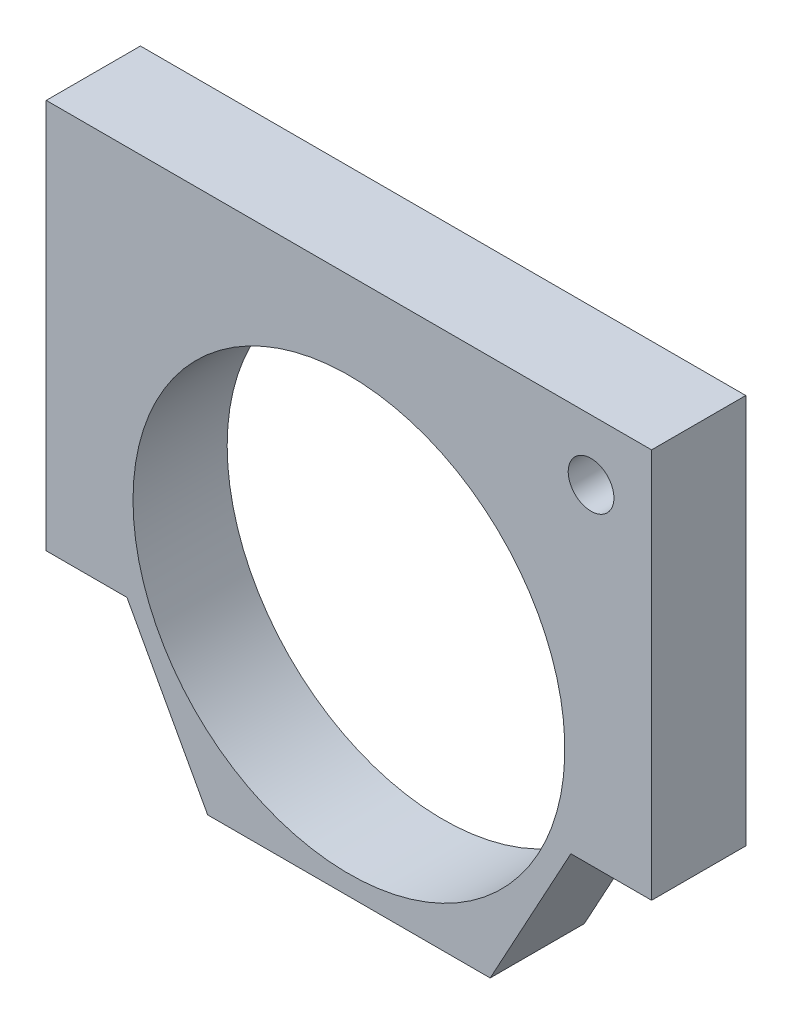
ISO-10303-21;
HEADER;
FILE_DESCRIPTION(('STEP AP214'),'2;1');
FILE_NAME('part.step','',(''),(''),'','','');
FILE_SCHEMA(('AUTOMOTIVE_DESIGN { 1 0 10303 214 1 1 1 1 }'));
ENDSEC;
DATA;
#1=APPLICATION_CONTEXT('core data for automotive mechanical design processes');
#2=APPLICATION_PROTOCOL_DEFINITION('international standard','automotive_design',2000,#1);
#3=PRODUCT_CONTEXT('',#1,'mechanical');
#4=PRODUCT('Part','Part','',(#3));
#5=PRODUCT_RELATED_PRODUCT_CATEGORY('part','',(#4));
#6=PRODUCT_DEFINITION_FORMATION('','',#4);
#7=PRODUCT_DEFINITION_CONTEXT('part definition',#1,'design');
#8=PRODUCT_DEFINITION('design','',#6,#7);
#9=PRODUCT_DEFINITION_SHAPE('','',#8);
#10=(LENGTH_UNIT() NAMED_UNIT(*) SI_UNIT(.MILLI.,.METRE.));
#11=(NAMED_UNIT(*) PLANE_ANGLE_UNIT() SI_UNIT($,.RADIAN.));
#12=(NAMED_UNIT(*) SI_UNIT($,.STERADIAN.) SOLID_ANGLE_UNIT());
#13=UNCERTAINTY_MEASURE_WITH_UNIT(LENGTH_MEASURE(1.E-05),#10,'distance_accuracy_value','');
#14=(GEOMETRIC_REPRESENTATION_CONTEXT(3) GLOBAL_UNCERTAINTY_ASSIGNED_CONTEXT((#13)) GLOBAL_UNIT_ASSIGNED_CONTEXT((#10,
#11,#12)) REPRESENTATION_CONTEXT('',''));
#15=CARTESIAN_POINT('',(0.,0.,0.));
#16=DIRECTION('',(0.,0.,1.));
#17=DIRECTION('',(1.,0.,0.));
#18=AXIS2_PLACEMENT_3D('',#15,#16,#17);
#19=CARTESIAN_POINT('',(0.,0.,3.5));
#20=DIRECTION('',(0.,0.,-1.));
#21=DIRECTION('',(-1.,0.,0.));
#22=AXIS2_PLACEMENT_3D('',#19,#20,#21);
#23=PLANE('',#22);
#24=CARTESIAN_POINT('',(18.,15.5,3.5));
#25=DIRECTION('',(0.,0.,-1.));
#26=DIRECTION('',(-1.,0.,0.));
#27=AXIS2_PLACEMENT_3D('',#24,#25,#26);
#28=CIRCLE('',#27,1.7);
#29=CARTESIAN_POINT('',(16.3,15.5,3.5));
#30=VERTEX_POINT('',#29);
#31=EDGE_CURVE('E250',#30,#30,#28,.F.);
#32=ORIENTED_EDGE('',*,*,#31,.F.);
#33=EDGE_LOOP('',(#32));
#34=FACE_BOUND('',#33,.T.);
#35=DIRECTION('',(1.,0.,0.));
#36=VECTOR('',#35,1.);
#37=CARTESIAN_POINT('',(-22.5,-20.,3.5));
#38=LINE('',#37,#36);
#39=CARTESIAN_POINT('',(-10.5,-20.,3.5));
#40=VERTEX_POINT('',#39);
#41=CARTESIAN_POINT('',(10.5,-20.,3.5));
#42=VERTEX_POINT('',#41);
#43=EDGE_CURVE('E170',#40,#42,#38,.T.);
#44=ORIENTED_EDGE('',*,*,#43,.T.);
#45=DIRECTION('',(0.478852130680573,0.877895572914384,0.));
#46=VECTOR('',#45,1.);
#47=CARTESIAN_POINT('',(16.5,-9.00000000000001,3.5));
#48=LINE('',#47,#46);
#49=CARTESIAN_POINT('',(16.5,-9.,3.5));
#50=VERTEX_POINT('',#49);
#51=EDGE_CURVE('E65',#42,#50,#48,.T.);
#52=ORIENTED_EDGE('',*,*,#51,.T.);
#53=DIRECTION('',(1.,0.,0.));
#54=VECTOR('',#53,1.);
#55=CARTESIAN_POINT('',(0.,-9.,3.5));
#56=LINE('',#55,#54);
#57=CARTESIAN_POINT('',(22.5,-9.,3.5));
#58=VERTEX_POINT('',#57);
#59=EDGE_CURVE('E146',#50,#58,#56,.T.);
#60=ORIENTED_EDGE('',*,*,#59,.T.);
#61=DIRECTION('',(0.,1.,0.));
#62=VECTOR('',#61,1.);
#63=CARTESIAN_POINT('',(22.5,-20.,3.5));
#64=LINE('',#63,#62);
#65=CARTESIAN_POINT('',(22.5,20.,3.5));
#66=VERTEX_POINT('',#65);
#67=EDGE_CURVE('E163',#58,#66,#64,.T.);
#68=ORIENTED_EDGE('',*,*,#67,.T.);
#69=DIRECTION('',(-1.,0.,0.));
#70=VECTOR('',#69,1.);
#71=CARTESIAN_POINT('',(-22.5,20.,3.5));
#72=LINE('',#71,#70);
#73=CARTESIAN_POINT('',(-22.5,20.,3.5));
#74=VERTEX_POINT('',#73);
#75=EDGE_CURVE('E165',#66,#74,#72,.T.);
#76=ORIENTED_EDGE('',*,*,#75,.T.);
#77=DIRECTION('',(0.,-1.,0.));
#78=VECTOR('',#77,1.);
#79=CARTESIAN_POINT('',(-22.5,-20.,3.5));
#80=LINE('',#79,#78);
#81=CARTESIAN_POINT('',(-22.5,-9.,3.5));
#82=VERTEX_POINT('',#81);
#83=EDGE_CURVE('E167',#74,#82,#80,.T.);
#84=ORIENTED_EDGE('',*,*,#83,.T.);
#85=DIRECTION('',(1.,0.,0.));
#86=VECTOR('',#85,1.);
#87=CARTESIAN_POINT('',(0.,-9.,3.5));
#88=LINE('',#87,#86);
#89=CARTESIAN_POINT('',(-16.5,-9.,3.5));
#90=VERTEX_POINT('',#89);
#91=EDGE_CURVE('E132',#82,#90,#88,.T.);
#92=ORIENTED_EDGE('',*,*,#91,.T.);
#93=DIRECTION('',(0.478852130680574,-0.877895572914384,0.));
#94=VECTOR('',#93,1.);
#95=CARTESIAN_POINT('',(-16.5,-9.00000000000001,3.5));
#96=LINE('',#95,#94);
#97=EDGE_CURVE('E137',#90,#40,#96,.T.);
#98=ORIENTED_EDGE('',*,*,#97,.T.);
#99=EDGE_LOOP('',(#44,#52,#60,#68,#76,#84,#92,#98));
#100=FACE_BOUND('',#99,.T.);
#101=CARTESIAN_POINT('',(0.,-2.5,3.5));
#102=DIRECTION('',(0.,0.,-1.));
#103=DIRECTION('',(-1.,0.,0.));
#104=AXIS2_PLACEMENT_3D('',#101,#102,#103);
#105=CIRCLE('',#104,16.05);
#106=CARTESIAN_POINT('',(-16.05,-2.5,3.5));
#107=VERTEX_POINT('',#106);
#108=EDGE_CURVE('E176',#107,#107,#105,.F.);
#109=ORIENTED_EDGE('',*,*,#108,.F.);
#110=EDGE_LOOP('',(#109));
#111=FACE_BOUND('',#110,.T.);
#112=ADVANCED_FACE('F48',(#34,#100,#111),#23,.F.);
#113=CARTESIAN_POINT('',(0.,0.,-3.5));
#114=DIRECTION('',(0.,0.,-1.));
#115=DIRECTION('',(-1.,0.,0.));
#116=AXIS2_PLACEMENT_3D('',#113,#114,#115);
#117=PLANE('',#116);
#118=CARTESIAN_POINT('',(18.,15.5,-3.5));
#119=DIRECTION('',(0.,0.,-1.));
#120=DIRECTION('',(-1.,0.,0.));
#121=AXIS2_PLACEMENT_3D('',#118,#119,#120);
#122=CIRCLE('',#121,3.35);
#123=CARTESIAN_POINT('',(14.65,15.5,-3.5));
#124=VERTEX_POINT('',#123);
#125=EDGE_CURVE('E259',#124,#124,#122,.T.);
#126=ORIENTED_EDGE('',*,*,#125,.F.);
#127=EDGE_LOOP('',(#126));
#128=FACE_BOUND('',#127,.T.);
#129=DIRECTION('',(0.478852130680573,0.877895572914384,0.));
#130=VECTOR('',#129,1.);
#131=CARTESIAN_POINT('',(16.5,-9.00000000000001,-3.5));
#132=LINE('',#131,#130);
#133=CARTESIAN_POINT('',(10.5,-20.,-3.5));
#134=VERTEX_POINT('',#133);
#135=CARTESIAN_POINT('',(16.5,-9.,-3.5));
#136=VERTEX_POINT('',#135);
#137=EDGE_CURVE('E148',#134,#136,#132,.T.);
#138=ORIENTED_EDGE('',*,*,#137,.F.);
#139=DIRECTION('',(1.,0.,0.));
#140=VECTOR('',#139,1.);
#141=CARTESIAN_POINT('',(-22.5,-20.,-3.5));
#142=LINE('',#141,#140);
#143=CARTESIAN_POINT('',(-10.5,-20.,-3.5));
#144=VERTEX_POINT('',#143);
#145=EDGE_CURVE('E145',#144,#134,#142,.T.);
#146=ORIENTED_EDGE('',*,*,#145,.F.);
#147=DIRECTION('',(0.478852130680574,-0.877895572914384,0.));
#148=VECTOR('',#147,1.);
#149=CARTESIAN_POINT('',(-16.5,-9.00000000000001,-3.5));
#150=LINE('',#149,#148);
#151=CARTESIAN_POINT('',(-16.5,-9.,-3.5));
#152=VERTEX_POINT('',#151);
#153=EDGE_CURVE('E73',#152,#144,#150,.T.);
#154=ORIENTED_EDGE('',*,*,#153,.F.);
#155=DIRECTION('',(1.,0.,0.));
#156=VECTOR('',#155,1.);
#157=CARTESIAN_POINT('',(0.,-9.,-3.5));
#158=LINE('',#157,#156);
#159=CARTESIAN_POINT('',(-22.5,-9.,-3.5));
#160=VERTEX_POINT('',#159);
#161=EDGE_CURVE('E123',#160,#152,#158,.T.);
#162=ORIENTED_EDGE('',*,*,#161,.F.);
#163=DIRECTION('',(0.,-1.,0.));
#164=VECTOR('',#163,1.);
#165=CARTESIAN_POINT('',(-22.5,-20.,-3.5));
#166=LINE('',#165,#164);
#167=CARTESIAN_POINT('',(-22.5,20.,-3.5));
#168=VERTEX_POINT('',#167);
#169=EDGE_CURVE('E178',#168,#160,#166,.T.);
#170=ORIENTED_EDGE('',*,*,#169,.F.);
#171=DIRECTION('',(-1.,0.,0.));
#172=VECTOR('',#171,1.);
#173=CARTESIAN_POINT('',(-22.5,20.,-3.5));
#174=LINE('',#173,#172);
#175=CARTESIAN_POINT('',(22.5,20.,-3.5));
#176=VERTEX_POINT('',#175);
#177=EDGE_CURVE('E175',#176,#168,#174,.T.);
#178=ORIENTED_EDGE('',*,*,#177,.F.);
#179=DIRECTION('',(0.,1.,0.));
#180=VECTOR('',#179,1.);
#181=CARTESIAN_POINT('',(22.5,-20.,-3.5));
#182=LINE('',#181,#180);
#183=CARTESIAN_POINT('',(22.5,-9.,-3.5));
#184=VERTEX_POINT('',#183);
#185=EDGE_CURVE('E173',#184,#176,#182,.T.);
#186=ORIENTED_EDGE('',*,*,#185,.F.);
#187=DIRECTION('',(1.,0.,0.));
#188=VECTOR('',#187,1.);
#189=CARTESIAN_POINT('',(0.,-9.,-3.5));
#190=LINE('',#189,#188);
#191=EDGE_CURVE('E151',#136,#184,#190,.T.);
#192=ORIENTED_EDGE('',*,*,#191,.F.);
#193=EDGE_LOOP('',(#138,#146,#154,#162,#170,#178,#186,#192));
#194=FACE_BOUND('',#193,.T.);
#195=CARTESIAN_POINT('',(0.,-2.5,-3.5));
#196=DIRECTION('',(0.,0.,-1.));
#197=DIRECTION('',(-1.,0.,0.));
#198=AXIS2_PLACEMENT_3D('',#195,#196,#197);
#199=CIRCLE('',#198,16.05);
#200=CARTESIAN_POINT('',(-16.05,-2.5,-3.5));
#201=VERTEX_POINT('',#200);
#202=EDGE_CURVE('E52',#201,#201,#199,.F.);
#203=ORIENTED_EDGE('',*,*,#202,.T.);
#204=EDGE_LOOP('',(#203));
#205=FACE_BOUND('',#204,.T.);
#206=ADVANCED_FACE('F142',(#128,#194,#205),#117,.T.);
#207=CARTESIAN_POINT('',(22.5,-20.,3.5));
#208=DIRECTION('',(-1.,0.,0.));
#209=DIRECTION('',(0.,0.,1.));
#210=AXIS2_PLACEMENT_3D('',#207,#208,#209);
#211=PLANE('',#210);
#212=ORIENTED_EDGE('',*,*,#67,.F.);
#213=DIRECTION('',(0.,0.,1.));
#214=VECTOR('',#213,1.);
#215=CARTESIAN_POINT('',(22.5,-9.,-5.));
#216=LINE('',#215,#214);
#217=EDGE_CURVE('E232',#184,#58,#216,.T.);
#218=ORIENTED_EDGE('',*,*,#217,.F.);
#219=ORIENTED_EDGE('',*,*,#185,.T.);
#220=DIRECTION('',(0.,0.,-1.));
#221=VECTOR('',#220,1.);
#222=CARTESIAN_POINT('',(22.5,20.,3.5));
#223=LINE('',#222,#221);
#224=EDGE_CURVE('E12',#66,#176,#223,.T.);
#225=ORIENTED_EDGE('',*,*,#224,.F.);
#226=EDGE_LOOP('',(#212,#218,#219,#225));
#227=FACE_BOUND('',#226,.T.);
#228=ADVANCED_FACE('F210',(#227),#211,.F.);
#229=CARTESIAN_POINT('',(-22.5,20.,3.5));
#230=DIRECTION('',(0.,-1.,0.));
#231=DIRECTION('',(0.,0.,-1.));
#232=AXIS2_PLACEMENT_3D('',#229,#230,#231);
#233=PLANE('',#232);
#234=ORIENTED_EDGE('',*,*,#177,.T.);
#235=DIRECTION('',(0.,0.,-1.));
#236=VECTOR('',#235,1.);
#237=CARTESIAN_POINT('',(-22.5,20.,3.5));
#238=LINE('',#237,#236);
#239=EDGE_CURVE('E57',#74,#168,#238,.T.);
#240=ORIENTED_EDGE('',*,*,#239,.F.);
#241=ORIENTED_EDGE('',*,*,#75,.F.);
#242=ORIENTED_EDGE('',*,*,#224,.T.);
#243=EDGE_LOOP('',(#234,#240,#241,#242));
#244=FACE_BOUND('',#243,.T.);
#245=ADVANCED_FACE('F221',(#244),#233,.F.);
#246=CARTESIAN_POINT('',(-22.5,-20.,3.5));
#247=DIRECTION('',(1.,0.,0.));
#248=DIRECTION('',(0.,0.,-1.));
#249=AXIS2_PLACEMENT_3D('',#246,#247,#248);
#250=PLANE('',#249);
#251=ORIENTED_EDGE('',*,*,#169,.T.);
#252=DIRECTION('',(0.,0.,1.));
#253=VECTOR('',#252,1.);
#254=CARTESIAN_POINT('',(-22.5,-9.,-5.));
#255=LINE('',#254,#253);
#256=EDGE_CURVE('E128',#160,#82,#255,.T.);
#257=ORIENTED_EDGE('',*,*,#256,.T.);
#258=ORIENTED_EDGE('',*,*,#83,.F.);
#259=ORIENTED_EDGE('',*,*,#239,.T.);
#260=EDGE_LOOP('',(#251,#257,#258,#259));
#261=FACE_BOUND('',#260,.T.);
#262=ADVANCED_FACE('F201',(#261),#250,.F.);
#263=CARTESIAN_POINT('',(-22.5,-20.,3.5));
#264=DIRECTION('',(0.,1.,0.));
#265=DIRECTION('',(0.,0.,1.));
#266=AXIS2_PLACEMENT_3D('',#263,#264,#265);
#267=PLANE('',#266);
#268=ORIENTED_EDGE('',*,*,#145,.T.);
#269=DIRECTION('',(0.,0.,1.));
#270=VECTOR('',#269,1.);
#271=CARTESIAN_POINT('',(10.5,-20.,-5.));
#272=LINE('',#271,#270);
#273=EDGE_CURVE('E185',#134,#42,#272,.T.);
#274=ORIENTED_EDGE('',*,*,#273,.T.);
#275=ORIENTED_EDGE('',*,*,#43,.F.);
#276=DIRECTION('',(0.,0.,1.));
#277=VECTOR('',#276,1.);
#278=CARTESIAN_POINT('',(-10.5,-20.,-5.));
#279=LINE('',#278,#277);
#280=EDGE_CURVE('E138',#144,#40,#279,.T.);
#281=ORIENTED_EDGE('',*,*,#280,.F.);
#282=EDGE_LOOP('',(#268,#274,#275,#281));
#283=FACE_BOUND('',#282,.T.);
#284=ADVANCED_FACE('F195',(#283),#267,.F.);
#285=CARTESIAN_POINT('',(0.,-2.5,3.5));
#286=DIRECTION('',(0.,0.,-1.));
#287=DIRECTION('',(-1.,0.,0.));
#288=AXIS2_PLACEMENT_3D('',#285,#286,#287);
#289=CYLINDRICAL_SURFACE('',#288,16.05);
#290=ORIENTED_EDGE('',*,*,#108,.T.);
#291=EDGE_LOOP('',(#290));
#292=FACE_BOUND('',#291,.T.);
#293=ORIENTED_EDGE('',*,*,#202,.F.);
#294=EDGE_LOOP('',(#293));
#295=FACE_BOUND('',#294,.T.);
#296=ADVANCED_FACE('F50',(#292,#295),#289,.F.);
#297=CARTESIAN_POINT('',(-10.5,-20.,-5.));
#298=DIRECTION('',(0.877895572914384,0.478852130680574,0.));
#299=DIRECTION('',(-0.478852130680574,0.877895572914384,0.));
#300=AXIS2_PLACEMENT_3D('',#297,#298,#299);
#301=PLANE('',#300);
#302=DIRECTION('',(0.,0.,1.));
#303=VECTOR('',#302,1.);
#304=CARTESIAN_POINT('',(-16.5,-9.,-5.));
#305=LINE('',#304,#303);
#306=EDGE_CURVE('E125',#152,#90,#305,.T.);
#307=ORIENTED_EDGE('',*,*,#306,.F.);
#308=ORIENTED_EDGE('',*,*,#153,.T.);
#309=ORIENTED_EDGE('',*,*,#280,.T.);
#310=ORIENTED_EDGE('',*,*,#97,.F.);
#311=EDGE_LOOP('',(#307,#308,#309,#310));
#312=FACE_BOUND('',#311,.T.);
#313=ADVANCED_FACE('F135',(#312),#301,.F.);
#314=CARTESIAN_POINT('',(-16.5,-9.,-5.));
#315=DIRECTION('',(0.,1.,0.));
#316=DIRECTION('',(-1.,0.,0.));
#317=AXIS2_PLACEMENT_3D('',#314,#315,#316);
#318=PLANE('',#317);
#319=CARTESIAN_POINT('',(-18.4999999999997,-9.,3.05311331771918E-13));
#320=DIRECTION('',(0.,1.,0.));
#321=DIRECTION('',(-1.,0.,0.));
#322=AXIS2_PLACEMENT_3D('',#319,#320,#321);
#323=CIRCLE('',#322,1.24999999999999);
#324=CARTESIAN_POINT('',(-19.7499999999997,-9.,3.05311331771918E-13));
#325=VERTEX_POINT('',#324);
#326=EDGE_CURVE('E133',#325,#325,#323,.F.);
#327=ORIENTED_EDGE('',*,*,#326,.F.);
#328=EDGE_LOOP('',(#327));
#329=FACE_BOUND('',#328,.T.);
#330=ORIENTED_EDGE('',*,*,#256,.F.);
#331=ORIENTED_EDGE('',*,*,#161,.T.);
#332=ORIENTED_EDGE('',*,*,#306,.T.);
#333=ORIENTED_EDGE('',*,*,#91,.F.);
#334=EDGE_LOOP('',(#330,#331,#332,#333));
#335=FACE_BOUND('',#334,.T.);
#336=ADVANCED_FACE('F124',(#329,#335),#318,.F.);
#337=CARTESIAN_POINT('',(10.5,-20.,-5.));
#338=DIRECTION('',(-0.877895572914384,0.478852130680573,0.));
#339=DIRECTION('',(-0.478852130680573,-0.877895572914384,0.));
#340=AXIS2_PLACEMENT_3D('',#337,#338,#339);
#341=PLANE('',#340);
#342=ORIENTED_EDGE('',*,*,#273,.F.);
#343=ORIENTED_EDGE('',*,*,#137,.T.);
#344=DIRECTION('',(0.,0.,1.));
#345=VECTOR('',#344,1.);
#346=CARTESIAN_POINT('',(16.5,-9.,-5.));
#347=LINE('',#346,#345);
#348=EDGE_CURVE('E246',#136,#50,#347,.T.);
#349=ORIENTED_EDGE('',*,*,#348,.T.);
#350=ORIENTED_EDGE('',*,*,#51,.F.);
#351=EDGE_LOOP('',(#342,#343,#349,#350));
#352=FACE_BOUND('',#351,.T.);
#353=ADVANCED_FACE('F264',(#352),#341,.F.);
#354=CARTESIAN_POINT('',(16.5,-9.,-5.));
#355=DIRECTION('',(0.,1.,0.));
#356=DIRECTION('',(0.,0.,1.));
#357=AXIS2_PLACEMENT_3D('',#354,#355,#356);
#358=PLANE('',#357);
#359=CARTESIAN_POINT('',(18.5000000000012,-9.,3.05311331771918E-13));
#360=DIRECTION('',(0.,1.,0.));
#361=DIRECTION('',(0.,0.,1.));
#362=AXIS2_PLACEMENT_3D('',#359,#360,#361);
#363=CIRCLE('',#362,1.24999999999999);
#364=CARTESIAN_POINT('',(18.5000000000012,-9.,1.2500000000003));
#365=VERTEX_POINT('',#364);
#366=EDGE_CURVE('E186',#365,#365,#363,.F.);
#367=ORIENTED_EDGE('',*,*,#366,.F.);
#368=EDGE_LOOP('',(#367));
#369=FACE_BOUND('',#368,.T.);
#370=ORIENTED_EDGE('',*,*,#348,.F.);
#371=ORIENTED_EDGE('',*,*,#191,.T.);
#372=ORIENTED_EDGE('',*,*,#217,.T.);
#373=ORIENTED_EDGE('',*,*,#59,.F.);
#374=EDGE_LOOP('',(#370,#371,#372,#373));
#375=FACE_BOUND('',#374,.T.);
#376=ADVANCED_FACE('F245',(#369,#375),#358,.F.);
#377=CARTESIAN_POINT('',(-18.4999999999997,0.,3.05311331771918E-13));
#378=DIRECTION('',(0.,-1.,0.));
#379=DIRECTION('',(0.,0.,-1.));
#380=AXIS2_PLACEMENT_3D('',#377,#378,#379);
#381=CONICAL_SURFACE('',#380,1.24999999999999,1.02974425867665);
#382=CARTESIAN_POINT('',(-18.4999999999997,0.75107577378446,3.05311331771918E-13));
#383=VERTEX_POINT('',#382);
#384=VERTEX_LOOP('',#383);
#385=FACE_BOUND('',#384,.T.);
#386=CARTESIAN_POINT('',(-18.4999999999997,0.,3.05311331771918E-13));
#387=DIRECTION('',(0.,-1.,0.));
#388=DIRECTION('',(0.,0.,-1.));
#389=AXIS2_PLACEMENT_3D('',#386,#387,#388);
#390=CIRCLE('',#389,1.24999999999999);
#391=CARTESIAN_POINT('',(-18.4999999999997,0.,-1.24999999999969));
#392=VERTEX_POINT('',#391);
#393=EDGE_CURVE('E157',#392,#392,#390,.T.);
#394=ORIENTED_EDGE('',*,*,#393,.T.);
#395=EDGE_LOOP('',(#394));
#396=FACE_BOUND('',#395,.T.);
#397=ADVANCED_FACE('F271',(#385,#396),#381,.F.);
#398=CARTESIAN_POINT('',(-18.4999999999997,-25.,3.05311331771918E-13));
#399=DIRECTION('',(0.,-1.,0.));
#400=DIRECTION('',(0.,0.,-1.));
#401=AXIS2_PLACEMENT_3D('',#398,#399,#400);
#402=CYLINDRICAL_SURFACE('',#401,1.24999999999999);
#403=ORIENTED_EDGE('',*,*,#326,.T.);
#404=EDGE_LOOP('',(#403));
#405=FACE_BOUND('',#404,.T.);
#406=ORIENTED_EDGE('',*,*,#393,.F.);
#407=EDGE_LOOP('',(#406));
#408=FACE_BOUND('',#407,.T.);
#409=ADVANCED_FACE('F280',(#405,#408),#402,.F.);
#410=CARTESIAN_POINT('',(18.5000000000012,0.,3.05311331771918E-13));
#411=DIRECTION('',(0.,-1.,0.));
#412=DIRECTION('',(0.,0.,-1.));
#413=AXIS2_PLACEMENT_3D('',#410,#411,#412);
#414=CONICAL_SURFACE('',#413,1.24999999999999,1.02974425867665);
#415=CARTESIAN_POINT('',(18.5000000000012,0.75107577378446,3.05311331771918E-13));
#416=VERTEX_POINT('',#415);
#417=VERTEX_LOOP('',#416);
#418=FACE_BOUND('',#417,.T.);
#419=CARTESIAN_POINT('',(18.5000000000012,0.,3.05311331771918E-13));
#420=DIRECTION('',(0.,-1.,0.));
#421=DIRECTION('',(0.,0.,-1.));
#422=AXIS2_PLACEMENT_3D('',#419,#420,#421);
#423=CIRCLE('',#422,1.24999999999999);
#424=CARTESIAN_POINT('',(18.5000000000012,0.,-1.24999999999969));
#425=VERTEX_POINT('',#424);
#426=EDGE_CURVE('E160',#425,#425,#423,.T.);
#427=ORIENTED_EDGE('',*,*,#426,.T.);
#428=EDGE_LOOP('',(#427));
#429=FACE_BOUND('',#428,.T.);
#430=ADVANCED_FACE('F216',(#418,#429),#414,.F.);
#431=CARTESIAN_POINT('',(18.5000000000012,-25.,3.05311331771918E-13));
#432=DIRECTION('',(0.,-1.,0.));
#433=DIRECTION('',(0.,0.,-1.));
#434=AXIS2_PLACEMENT_3D('',#431,#432,#433);
#435=CYLINDRICAL_SURFACE('',#434,1.24999999999999);
#436=ORIENTED_EDGE('',*,*,#366,.T.);
#437=EDGE_LOOP('',(#436));
#438=FACE_BOUND('',#437,.T.);
#439=ORIENTED_EDGE('',*,*,#426,.F.);
#440=EDGE_LOOP('',(#439));
#441=FACE_BOUND('',#440,.T.);
#442=ADVANCED_FACE('F286',(#438,#441),#435,.F.);
#443=CARTESIAN_POINT('',(18.,15.5,-3.5));
#444=DIRECTION('',(0.,0.,-1.));
#445=DIRECTION('',(-1.,0.,0.));
#446=AXIS2_PLACEMENT_3D('',#443,#444,#445);
#447=CYLINDRICAL_SURFACE('',#446,1.7);
#448=ORIENTED_EDGE('',*,*,#31,.T.);
#449=EDGE_LOOP('',(#448));
#450=FACE_BOUND('',#449,.T.);
#451=CARTESIAN_POINT('',(18.,15.5,-0.849999999999998));
#452=DIRECTION('',(0.,0.,-1.));
#453=DIRECTION('',(-1.,0.,0.));
#454=AXIS2_PLACEMENT_3D('',#451,#452,#453);
#455=CIRCLE('',#454,1.7);
#456=CARTESIAN_POINT('',(16.3,15.5,-0.849999999999998));
#457=VERTEX_POINT('',#456);
#458=EDGE_CURVE('E252',#457,#457,#455,.T.);
#459=ORIENTED_EDGE('',*,*,#458,.T.);
#460=EDGE_LOOP('',(#459));
#461=FACE_BOUND('',#460,.T.);
#462=ADVANCED_FACE('F277',(#450,#461),#447,.F.);
#463=CARTESIAN_POINT('',(19.7,15.5,-0.849999999999998));
#464=DIRECTION('',(0.,0.,1.));
#465=DIRECTION('',(1.,0.,0.));
#466=AXIS2_PLACEMENT_3D('',#463,#464,#465);
#467=PLANE('',#466);
#468=ORIENTED_EDGE('',*,*,#458,.F.);
#469=EDGE_LOOP('',(#468));
#470=FACE_BOUND('',#469,.T.);
#471=CARTESIAN_POINT('',(18.,15.5,-0.849999999999998));
#472=DIRECTION('',(0.,0.,-1.));
#473=DIRECTION('',(-1.,0.,0.));
#474=AXIS2_PLACEMENT_3D('',#471,#472,#473);
#475=CIRCLE('',#474,3.35);
#476=CARTESIAN_POINT('',(14.65,15.5,-0.849999999999998));
#477=VERTEX_POINT('',#476);
#478=EDGE_CURVE('E256',#477,#477,#475,.T.);
#479=ORIENTED_EDGE('',*,*,#478,.T.);
#480=EDGE_LOOP('',(#479));
#481=FACE_BOUND('',#480,.T.);
#482=ADVANCED_FACE('F293',(#470,#481),#467,.F.);
#483=CARTESIAN_POINT('',(18.,15.5,-3.5));
#484=DIRECTION('',(0.,0.,-1.));
#485=DIRECTION('',(-1.,0.,0.));
#486=AXIS2_PLACEMENT_3D('',#483,#484,#485);
#487=CYLINDRICAL_SURFACE('',#486,3.35);
#488=ORIENTED_EDGE('',*,*,#478,.F.);
#489=EDGE_LOOP('',(#488));
#490=FACE_BOUND('',#489,.T.);
#491=ORIENTED_EDGE('',*,*,#125,.T.);
#492=EDGE_LOOP('',(#491));
#493=FACE_BOUND('',#492,.T.);
#494=ADVANCED_FACE('F422',(#490,#493),#487,.F.);
#495=CLOSED_SHELL('',(#112,#206,#228,#245,#262,#284,#296,#313,#336,#353,#376,#397,#409,#430,
#442,#462,#482,#494));
#496=MANIFOLD_SOLID_BREP('B2',#495);
#497=ADVANCED_BREP_SHAPE_REPRESENTATION('',(#18,#496),#14);
#498=SHAPE_DEFINITION_REPRESENTATION(#9,#497);
ENDSEC;
END-ISO-10303-21;
